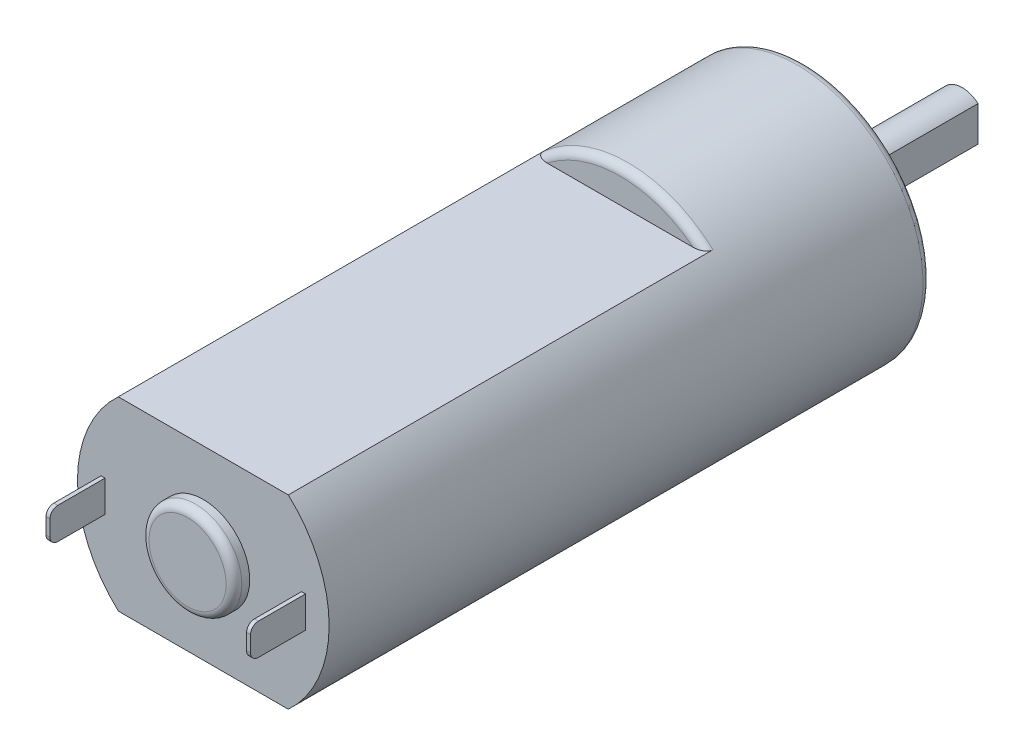
ISO-10303-21;
HEADER;
FILE_DESCRIPTION(('STEP AP214'),'2;1');
FILE_NAME('part.step','',(''),(''),'','','');
FILE_SCHEMA(('AUTOMOTIVE_DESIGN { 1 0 10303 214 1 1 1 1 }'));
ENDSEC;
DATA;
#1=APPLICATION_CONTEXT('core data for automotive mechanical design processes');
#2=APPLICATION_PROTOCOL_DEFINITION('international standard','automotive_design',2000,#1);
#3=PRODUCT_CONTEXT('',#1,'mechanical');
#4=PRODUCT('Part','Part','',(#3));
#5=PRODUCT_RELATED_PRODUCT_CATEGORY('part','',(#4));
#6=PRODUCT_DEFINITION_FORMATION('','',#4);
#7=PRODUCT_DEFINITION_CONTEXT('part definition',#1,'design');
#8=PRODUCT_DEFINITION('design','',#6,#7);
#9=PRODUCT_DEFINITION_SHAPE('','',#8);
#10=(LENGTH_UNIT() NAMED_UNIT(*) SI_UNIT(.MILLI.,.METRE.));
#11=(NAMED_UNIT(*) PLANE_ANGLE_UNIT() SI_UNIT($,.RADIAN.));
#12=(NAMED_UNIT(*) SI_UNIT($,.STERADIAN.) SOLID_ANGLE_UNIT());
#13=UNCERTAINTY_MEASURE_WITH_UNIT(LENGTH_MEASURE(1.E-05),#10,'distance_accuracy_value','');
#14=(GEOMETRIC_REPRESENTATION_CONTEXT(3) GLOBAL_UNCERTAINTY_ASSIGNED_CONTEXT((#13)) GLOBAL_UNIT_ASSIGNED_CONTEXT((#10,
#11,#12)) REPRESENTATION_CONTEXT('',''));
#15=CARTESIAN_POINT('',(0.,0.,0.));
#16=DIRECTION('',(0.,0.,1.));
#17=DIRECTION('',(1.,0.,0.));
#18=AXIS2_PLACEMENT_3D('',#15,#16,#17);
#19=CARTESIAN_POINT('',(8.,0.,38.25));
#20=DIRECTION('',(0.,0.,1.));
#21=DIRECTION('',(1.,0.,0.));
#22=AXIS2_PLACEMENT_3D('',#19,#20,#21);
#23=PLANE('',#22);
#24=CARTESIAN_POINT('',(0.,0.,38.25));
#25=DIRECTION('',(0.,0.,1.));
#26=DIRECTION('',(1.,0.,0.));
#27=AXIS2_PLACEMENT_3D('',#24,#25,#26);
#28=CIRCLE('',#27,2.95);
#29=CARTESIAN_POINT('',(2.95,0.,38.25));
#30=VERTEX_POINT('',#29);
#31=EDGE_CURVE('E208',#30,#30,#28,.T.);
#32=ORIENTED_EDGE('',*,*,#31,.F.);
#33=EDGE_LOOP('',(#32));
#34=FACE_BOUND('',#33,.T.);
#35=DIRECTION('',(-1.,0.,0.));
#36=VECTOR('',#35,1.);
#37=CARTESIAN_POINT('',(5.40277706369604,-5.9,38.25));
#38=LINE('',#37,#36);
#39=CARTESIAN_POINT('',(5.40277706369604,-5.9,38.25));
#40=VERTEX_POINT('',#39);
#41=CARTESIAN_POINT('',(-5.40277706369604,-5.9,38.25));
#42=VERTEX_POINT('',#41);
#43=EDGE_CURVE('E249',#40,#42,#38,.T.);
#44=ORIENTED_EDGE('',*,*,#43,.F.);
#45=CARTESIAN_POINT('',(0.,0.,38.25));
#46=DIRECTION('',(0.,0.,-1.));
#47=DIRECTION('',(-1.,0.,0.));
#48=AXIS2_PLACEMENT_3D('',#45,#46,#47);
#49=CIRCLE('',#48,8.);
#50=CARTESIAN_POINT('',(5.40277706369604,5.9,38.25));
#51=VERTEX_POINT('',#50);
#52=EDGE_CURVE('E304',#51,#40,#49,.T.);
#53=ORIENTED_EDGE('',*,*,#52,.F.);
#54=DIRECTION('',(1.,0.,0.));
#55=VECTOR('',#54,1.);
#56=CARTESIAN_POINT('',(-5.40277706369604,5.9,38.25));
#57=LINE('',#56,#55);
#58=CARTESIAN_POINT('',(-5.40277706369604,5.9,38.25));
#59=VERTEX_POINT('',#58);
#60=EDGE_CURVE('E258',#59,#51,#57,.T.);
#61=ORIENTED_EDGE('',*,*,#60,.F.);
#62=EDGE_CURVE('E299',#42,#59,#49,.T.);
#63=ORIENTED_EDGE('',*,*,#62,.F.);
#64=EDGE_LOOP('',(#44,#53,#61,#63));
#65=FACE_BOUND('',#64,.T.);
#66=DIRECTION('',(1.,0.,0.));
#67=VECTOR('',#66,1.);
#68=CARTESIAN_POINT('',(-6.25,-1.,38.25));
#69=LINE('',#68,#67);
#70=CARTESIAN_POINT('',(-6.5,-1.,38.25));
#71=VERTEX_POINT('',#70);
#72=CARTESIAN_POINT('',(-6.25,-1.,38.25));
#73=VERTEX_POINT('',#72);
#74=EDGE_CURVE('E234',#71,#73,#69,.T.);
#75=ORIENTED_EDGE('',*,*,#74,.F.);
#76=DIRECTION('',(0.,-1.,0.));
#77=VECTOR('',#76,1.);
#78=CARTESIAN_POINT('',(-6.5,-1.,38.25));
#79=LINE('',#78,#77);
#80=CARTESIAN_POINT('',(-6.5,1.,38.25));
#81=VERTEX_POINT('',#80);
#82=EDGE_CURVE('E196',#81,#71,#79,.T.);
#83=ORIENTED_EDGE('',*,*,#82,.F.);
#84=DIRECTION('',(-1.,0.,0.));
#85=VECTOR('',#84,1.);
#86=CARTESIAN_POINT('',(-6.5,1.,38.25));
#87=LINE('',#86,#85);
#88=CARTESIAN_POINT('',(-6.25,1.,38.25));
#89=VERTEX_POINT('',#88);
#90=EDGE_CURVE('E228',#89,#81,#87,.T.);
#91=ORIENTED_EDGE('',*,*,#90,.F.);
#92=DIRECTION('',(0.,1.,0.));
#93=VECTOR('',#92,1.);
#94=CARTESIAN_POINT('',(-6.25,1.,38.25));
#95=LINE('',#94,#93);
#96=EDGE_CURVE('E237',#73,#89,#95,.T.);
#97=ORIENTED_EDGE('',*,*,#96,.F.);
#98=EDGE_LOOP('',(#75,#83,#91,#97));
#99=FACE_BOUND('',#98,.T.);
#100=DIRECTION('',(1.,0.,0.));
#101=VECTOR('',#100,1.);
#102=CARTESIAN_POINT('',(6.5,-1.,38.25));
#103=LINE('',#102,#101);
#104=CARTESIAN_POINT('',(6.25,-1.,38.25));
#105=VERTEX_POINT('',#104);
#106=CARTESIAN_POINT('',(6.5,-1.,38.25));
#107=VERTEX_POINT('',#106);
#108=EDGE_CURVE('E190',#105,#107,#103,.T.);
#109=ORIENTED_EDGE('',*,*,#108,.F.);
#110=DIRECTION('',(0.,-1.,0.));
#111=VECTOR('',#110,1.);
#112=CARTESIAN_POINT('',(6.25,-1.,38.25));
#113=LINE('',#112,#111);
#114=CARTESIAN_POINT('',(6.25,1.,38.25));
#115=VERTEX_POINT('',#114);
#116=EDGE_CURVE('E200',#115,#105,#113,.T.);
#117=ORIENTED_EDGE('',*,*,#116,.F.);
#118=DIRECTION('',(-1.,0.,0.));
#119=VECTOR('',#118,1.);
#120=CARTESIAN_POINT('',(6.25,1.,38.25));
#121=LINE('',#120,#119);
#122=CARTESIAN_POINT('',(6.5,1.,38.25));
#123=VERTEX_POINT('',#122);
#124=EDGE_CURVE('E213',#123,#115,#121,.T.);
#125=ORIENTED_EDGE('',*,*,#124,.F.);
#126=DIRECTION('',(0.,1.,0.));
#127=VECTOR('',#126,1.);
#128=CARTESIAN_POINT('',(6.5,1.,38.25));
#129=LINE('',#128,#127);
#130=EDGE_CURVE('E211',#107,#123,#129,.T.);
#131=ORIENTED_EDGE('',*,*,#130,.F.);
#132=EDGE_LOOP('',(#109,#117,#125,#131));
#133=FACE_BOUND('',#132,.T.);
#134=ADVANCED_FACE('F36',(#34,#65,#99,#133),#23,.T.);
#135=CARTESIAN_POINT('',(0.,0.,38.25));
#136=DIRECTION('',(0.,0.,-1.));
#137=DIRECTION('',(-1.,0.,0.));
#138=AXIS2_PLACEMENT_3D('',#135,#136,#137);
#139=CYLINDRICAL_SURFACE('',#138,8.);
#140=CARTESIAN_POINT('',(0.,0.,0.5));
#141=DIRECTION('',(0.,0.,-1.));
#142=DIRECTION('',(-1.,0.,0.));
#143=AXIS2_PLACEMENT_3D('',#140,#141,#142);
#144=CIRCLE('',#143,8.);
#145=CARTESIAN_POINT('',(-8.,0.,0.5));
#146=VERTEX_POINT('',#145);
#147=EDGE_CURVE('E342',#146,#146,#144,.F.);
#148=ORIENTED_EDGE('',*,*,#147,.T.);
#149=EDGE_LOOP('',(#148));
#150=FACE_BOUND('',#149,.T.);
#151=DIRECTION('',(0.,0.,1.));
#152=VECTOR('',#151,1.);
#153=CARTESIAN_POINT('',(5.40277706369604,-5.9,11.75));
#154=LINE('',#153,#152);
#155=CARTESIAN_POINT('',(5.40277706369604,-5.9,11.25));
#156=VERTEX_POINT('',#155);
#157=EDGE_CURVE('E253',#156,#40,#154,.T.);
#158=ORIENTED_EDGE('',*,*,#157,.F.);
#159=CARTESIAN_POINT('',(0.,0.,11.25));
#160=DIRECTION('',(0.,0.,1.));
#161=DIRECTION('',(1.,0.,0.));
#162=AXIS2_PLACEMENT_3D('',#159,#160,#161);
#163=CIRCLE('',#162,8.);
#164=CARTESIAN_POINT('',(-5.40277706369604,-5.9,11.25));
#165=VERTEX_POINT('',#164);
#166=EDGE_CURVE('E348',#156,#165,#163,.F.);
#167=ORIENTED_EDGE('',*,*,#166,.T.);
#168=DIRECTION('',(0.,0.,1.));
#169=VECTOR('',#168,1.);
#170=CARTESIAN_POINT('',(-5.40277706369604,-5.9,11.75));
#171=LINE('',#170,#169);
#172=EDGE_CURVE('E255',#165,#42,#171,.T.);
#173=ORIENTED_EDGE('',*,*,#172,.T.);
#174=ORIENTED_EDGE('',*,*,#62,.T.);
#175=DIRECTION('',(0.,0.,1.));
#176=VECTOR('',#175,1.);
#177=CARTESIAN_POINT('',(-5.40277706369604,5.9,11.75));
#178=LINE('',#177,#176);
#179=CARTESIAN_POINT('',(-5.40277706369604,5.9,11.25));
#180=VERTEX_POINT('',#179);
#181=EDGE_CURVE('E262',#180,#59,#178,.T.);
#182=ORIENTED_EDGE('',*,*,#181,.F.);
#183=CARTESIAN_POINT('',(0.,0.,11.25));
#184=DIRECTION('',(0.,0.,1.));
#185=DIRECTION('',(1.,0.,0.));
#186=AXIS2_PLACEMENT_3D('',#183,#184,#185);
#187=CIRCLE('',#186,8.);
#188=CARTESIAN_POINT('',(5.40277706369604,5.9,11.25));
#189=VERTEX_POINT('',#188);
#190=EDGE_CURVE('E345',#180,#189,#187,.F.);
#191=ORIENTED_EDGE('',*,*,#190,.T.);
#192=DIRECTION('',(0.,0.,1.));
#193=VECTOR('',#192,1.);
#194=CARTESIAN_POINT('',(5.40277706369604,5.9,11.75));
#195=LINE('',#194,#193);
#196=EDGE_CURVE('E264',#189,#51,#195,.T.);
#197=ORIENTED_EDGE('',*,*,#196,.T.);
#198=ORIENTED_EDGE('',*,*,#52,.T.);
#199=EDGE_LOOP('',(#158,#167,#173,#174,#182,#191,#197,#198));
#200=FACE_BOUND('',#199,.T.);
#201=ADVANCED_FACE('F440',(#150,#200),#139,.T.);
#202=CARTESIAN_POINT('',(0.,0.,0.));
#203=DIRECTION('',(0.,0.,-1.));
#204=DIRECTION('',(-1.,0.,0.));
#205=AXIS2_PLACEMENT_3D('',#202,#203,#204);
#206=PLANE('',#205);
#207=CARTESIAN_POINT('',(0.,0.,0.));
#208=DIRECTION('',(0.,0.,-1.));
#209=DIRECTION('',(-1.,0.,0.));
#210=AXIS2_PLACEMENT_3D('',#207,#208,#209);
#211=CIRCLE('',#210,7.5);
#212=CARTESIAN_POINT('',(-7.5,0.,0.));
#213=VERTEX_POINT('',#212);
#214=EDGE_CURVE('E355',#213,#213,#211,.T.);
#215=ORIENTED_EDGE('',*,*,#214,.T.);
#216=EDGE_LOOP('',(#215));
#217=FACE_BOUND('',#216,.T.);
#218=CARTESIAN_POINT('',(0.,0.,0.));
#219=DIRECTION('',(0.,0.,-1.));
#220=DIRECTION('',(0.,1.,0.));
#221=AXIS2_PLACEMENT_3D('',#218,#219,#220);
#222=CIRCLE('',#221,3.);
#223=CARTESIAN_POINT('',(0.,3.,0.));
#224=VERTEX_POINT('',#223);
#225=EDGE_CURVE('E300',#224,#224,#222,.T.);
#226=ORIENTED_EDGE('',*,*,#225,.F.);
#227=EDGE_LOOP('',(#226));
#228=FACE_BOUND('',#227,.T.);
#229=ADVANCED_FACE('F436',(#217,#228),#206,.T.);
#230=CARTESIAN_POINT('',(0.,0.,-2.));
#231=DIRECTION('',(0.,0.,1.));
#232=DIRECTION('',(0.,-1.,0.));
#233=AXIS2_PLACEMENT_3D('',#230,#231,#232);
#234=CYLINDRICAL_SURFACE('',#233,3.);
#235=CARTESIAN_POINT('',(0.,0.,-2.));
#236=DIRECTION('',(0.,0.,-1.));
#237=DIRECTION('',(0.,1.,0.));
#238=AXIS2_PLACEMENT_3D('',#235,#236,#237);
#239=CIRCLE('',#238,3.);
#240=CARTESIAN_POINT('',(0.,3.,-2.));
#241=VERTEX_POINT('',#240);
#242=EDGE_CURVE('E296',#241,#241,#239,.T.);
#243=ORIENTED_EDGE('',*,*,#242,.F.);
#244=EDGE_LOOP('',(#243));
#245=FACE_BOUND('',#244,.T.);
#246=ORIENTED_EDGE('',*,*,#225,.T.);
#247=EDGE_LOOP('',(#246));
#248=FACE_BOUND('',#247,.T.);
#249=ADVANCED_FACE('F432',(#245,#248),#234,.T.);
#250=CARTESIAN_POINT('',(0.,0.,-2.));
#251=DIRECTION('',(0.,0.,-1.));
#252=DIRECTION('',(0.,1.,0.));
#253=AXIS2_PLACEMENT_3D('',#250,#251,#252);
#254=PLANE('',#253);
#255=CARTESIAN_POINT('',(0.,0.,-2.));
#256=DIRECTION('',(0.,0.,-1.));
#257=DIRECTION('',(0.,1.,0.));
#258=AXIS2_PLACEMENT_3D('',#255,#256,#257);
#259=CIRCLE('',#258,1.5);
#260=CARTESIAN_POINT('',(1.,1.1180339887499,-2.));
#261=VERTEX_POINT('',#260);
#262=CARTESIAN_POINT('',(1.,-1.11803398874989,-2.));
#263=VERTEX_POINT('',#262);
#264=EDGE_CURVE('E267',#261,#263,#259,.T.);
#265=ORIENTED_EDGE('',*,*,#264,.F.);
#266=CARTESIAN_POINT('',(0.,0.,-2.));
#267=DIRECTION('',(0.,0.,-1.));
#268=DIRECTION('',(0.,-1.,0.));
#269=AXIS2_PLACEMENT_3D('',#266,#267,#268);
#270=CIRCLE('',#269,1.5);
#271=EDGE_CURVE('E280',#263,#261,#270,.T.);
#272=ORIENTED_EDGE('',*,*,#271,.F.);
#273=EDGE_LOOP('',(#265,#272));
#274=FACE_BOUND('',#273,.T.);
#275=ORIENTED_EDGE('',*,*,#242,.T.);
#276=EDGE_LOOP('',(#275));
#277=FACE_BOUND('',#276,.T.);
#278=ADVANCED_FACE('F428',(#274,#277),#254,.T.);
#279=CARTESIAN_POINT('',(0.,0.,-10.));
#280=DIRECTION('',(0.,0.,1.));
#281=DIRECTION('',(0.,-1.,0.));
#282=AXIS2_PLACEMENT_3D('',#279,#280,#281);
#283=CYLINDRICAL_SURFACE('',#282,1.5);
#284=ORIENTED_EDGE('',*,*,#271,.T.);
#285=DIRECTION('',(0.,0.,1.));
#286=VECTOR('',#285,1.);
#287=CARTESIAN_POINT('',(1.,1.1180339887499,-10.));
#288=LINE('',#287,#286);
#289=CARTESIAN_POINT('',(1.,1.1180339887499,-10.));
#290=VERTEX_POINT('',#289);
#291=EDGE_CURVE('E293',#290,#261,#288,.T.);
#292=ORIENTED_EDGE('',*,*,#291,.F.);
#293=CARTESIAN_POINT('',(0.,0.,-10.));
#294=DIRECTION('',(0.,0.,-1.));
#295=DIRECTION('',(0.,-1.,0.));
#296=AXIS2_PLACEMENT_3D('',#293,#294,#295);
#297=CIRCLE('',#296,1.5);
#298=CARTESIAN_POINT('',(1.,-1.11803398874989,-10.));
#299=VERTEX_POINT('',#298);
#300=EDGE_CURVE('E283',#299,#290,#297,.T.);
#301=ORIENTED_EDGE('',*,*,#300,.F.);
#302=DIRECTION('',(0.,0.,1.));
#303=VECTOR('',#302,1.);
#304=CARTESIAN_POINT('',(1.,-1.11803398874989,-10.));
#305=LINE('',#304,#303);
#306=EDGE_CURVE('E288',#299,#263,#305,.T.);
#307=ORIENTED_EDGE('',*,*,#306,.T.);
#308=EDGE_LOOP('',(#284,#292,#301,#307));
#309=FACE_BOUND('',#308,.T.);
#310=ADVANCED_FACE('F424',(#309),#283,.T.);
#311=CARTESIAN_POINT('',(1.,-1.11803398874989,-10.));
#312=DIRECTION('',(-1.,0.,0.));
#313=DIRECTION('',(0.,0.,1.));
#314=AXIS2_PLACEMENT_3D('',#311,#312,#313);
#315=PLANE('',#314);
#316=ORIENTED_EDGE('',*,*,#291,.T.);
#317=DIRECTION('',(0.,0.,-1.));
#318=VECTOR('',#317,1.);
#319=CARTESIAN_POINT('',(1.,1.1180339887499,0.));
#320=LINE('',#319,#318);
#321=CARTESIAN_POINT('',(1.,1.1180339887499,0.));
#322=VERTEX_POINT('',#321);
#323=EDGE_CURVE('E278',#322,#261,#320,.T.);
#324=ORIENTED_EDGE('',*,*,#323,.F.);
#325=DIRECTION('',(0.,1.,0.));
#326=VECTOR('',#325,1.);
#327=CARTESIAN_POINT('',(1.,-1.11803398874989,0.));
#328=LINE('',#327,#326);
#329=CARTESIAN_POINT('',(1.,-1.11803398874989,0.));
#330=VERTEX_POINT('',#329);
#331=EDGE_CURVE('E273',#330,#322,#328,.T.);
#332=ORIENTED_EDGE('',*,*,#331,.F.);
#333=DIRECTION('',(0.,0.,-1.));
#334=VECTOR('',#333,1.);
#335=CARTESIAN_POINT('',(1.,-1.11803398874989,0.));
#336=LINE('',#335,#334);
#337=EDGE_CURVE('E276',#330,#263,#336,.T.);
#338=ORIENTED_EDGE('',*,*,#337,.T.);
#339=ORIENTED_EDGE('',*,*,#306,.F.);
#340=DIRECTION('',(0.,-1.,0.));
#341=VECTOR('',#340,1.);
#342=CARTESIAN_POINT('',(1.,-1.11803398874989,-10.));
#343=LINE('',#342,#341);
#344=EDGE_CURVE('E286',#290,#299,#343,.T.);
#345=ORIENTED_EDGE('',*,*,#344,.F.);
#346=EDGE_LOOP('',(#316,#324,#332,#338,#339,#345));
#347=FACE_BOUND('',#346,.T.);
#348=ADVANCED_FACE('F420',(#347),#315,.F.);
#349=CARTESIAN_POINT('',(0.,0.,-10.));
#350=DIRECTION('',(0.,0.,1.));
#351=DIRECTION('',(0.,-1.,0.));
#352=AXIS2_PLACEMENT_3D('',#349,#350,#351);
#353=PLANE('',#352);
#354=ORIENTED_EDGE('',*,*,#300,.T.);
#355=ORIENTED_EDGE('',*,*,#344,.T.);
#356=EDGE_LOOP('',(#354,#355));
#357=FACE_BOUND('',#356,.T.);
#358=ADVANCED_FACE('F416',(#357),#353,.F.);
#359=CARTESIAN_POINT('',(0.,0.,0.));
#360=DIRECTION('',(0.,0.,-1.));
#361=DIRECTION('',(0.,1.,0.));
#362=AXIS2_PLACEMENT_3D('',#359,#360,#361);
#363=CYLINDRICAL_SURFACE('',#362,1.5);
#364=ORIENTED_EDGE('',*,*,#264,.T.);
#365=ORIENTED_EDGE('',*,*,#337,.F.);
#366=CARTESIAN_POINT('',(0.,0.,0.));
#367=DIRECTION('',(0.,0.,-1.));
#368=DIRECTION('',(0.,1.,0.));
#369=AXIS2_PLACEMENT_3D('',#366,#367,#368);
#370=CIRCLE('',#369,1.5);
#371=EDGE_CURVE('E270',#322,#330,#370,.T.);
#372=ORIENTED_EDGE('',*,*,#371,.F.);
#373=ORIENTED_EDGE('',*,*,#323,.T.);
#374=EDGE_LOOP('',(#364,#365,#372,#373));
#375=FACE_BOUND('',#374,.T.);
#376=ADVANCED_FACE('F412',(#375),#363,.F.);
#377=CARTESIAN_POINT('',(0.,0.,0.));
#378=DIRECTION('',(0.,0.,-1.));
#379=DIRECTION('',(0.,1.,0.));
#380=AXIS2_PLACEMENT_3D('',#377,#378,#379);
#381=PLANE('',#380);
#382=ORIENTED_EDGE('',*,*,#371,.T.);
#383=ORIENTED_EDGE('',*,*,#331,.T.);
#384=EDGE_LOOP('',(#382,#383));
#385=FACE_BOUND('',#384,.T.);
#386=ADVANCED_FACE('F408',(#385),#381,.T.);
#387=CARTESIAN_POINT('',(-5.40277706369604,5.9,11.75));
#388=DIRECTION('',(0.,-1.,0.));
#389=DIRECTION('',(0.,0.,-1.));
#390=AXIS2_PLACEMENT_3D('',#387,#388,#389);
#391=PLANE('',#390);
#392=ORIENTED_EDGE('',*,*,#60,.T.);
#393=ORIENTED_EDGE('',*,*,#196,.F.);
#394=CARTESIAN_POINT('',(5.40277706369604,5.9,11.25));
#395=CARTESIAN_POINT('',(5.40283148037578,5.9,11.271740354385));
#396=CARTESIAN_POINT('',(5.40068145650954,5.9,11.2934214979406));
#397=CARTESIAN_POINT('',(5.39244910932837,5.9,11.3358265552683));
#398=CARTESIAN_POINT('',(5.3864030966777,5.9,11.3565574336463));
#399=CARTESIAN_POINT('',(5.37086328192421,5.9,11.3965861080966));
#400=CARTESIAN_POINT('',(5.36137984485646,5.9,11.4158880045352));
#401=CARTESIAN_POINT('',(5.33956212620102,5.9,11.4528400580769));
#402=CARTESIAN_POINT('',(5.32722102379949,5.9,11.4704861190474));
#403=CARTESIAN_POINT('',(5.29445160223145,5.9,11.5111774949092));
#404=CARTESIAN_POINT('',(5.27283264556323,5.9,11.5332625133925));
#405=CARTESIAN_POINT('',(5.22637640918798,5.9,11.5737049632588));
#406=CARTESIAN_POINT('',(5.2015336638736,5.9,11.5920559250548));
#407=CARTESIAN_POINT('',(5.13742256599078,5.9,11.6331194854585));
#408=CARTESIAN_POINT('',(5.09686909393764,5.9,11.6538180088405));
#409=CARTESIAN_POINT('',(5.01299952806607,5.9,11.6887157540364));
#410=CARTESIAN_POINT('',(4.96967379886557,5.9,11.7028907291789));
#411=CARTESIAN_POINT('',(4.87719267147399,5.9,11.7266130845183));
#412=CARTESIAN_POINT('',(4.82788513532073,5.9,11.735562421789));
#413=CARTESIAN_POINT('',(4.7537022478666,5.9,11.7443221965645));
#414=CARTESIAN_POINT('',(4.72906854979428,5.9,11.7464654940399));
#415=CARTESIAN_POINT('',(4.67973666058774,5.9,11.7493022282933));
#416=CARTESIAN_POINT('',(4.65503853571052,5.9,11.7499968081944));
#417=CARTESIAN_POINT('',(4.63033476111609,5.9,11.75));
#418=B_SPLINE_CURVE_WITH_KNOTS('',3,(#394,#395,#396,#397,#398,#399,#400,#401,#402,#403,#404,
#405,#406,#407,#408,#409,#410,#411,#412,#413,#414,#415,#416,#417),.UNSPECIFIED.,.F.,.F.,(4,2,2,
2,2,2,2,2,2,2,2,4),(0.,0.0650211052531943,0.129444809797018,0.193675848768125,0.258061807259542,
0.350259855511827,0.442616309900562,0.578454145179496,0.714792862983398,0.86464712024773,
0.938793964878145,1.01288228113366),.UNSPECIFIED.);
#419=CARTESIAN_POINT('',(4.63033476111609,5.9,11.75));
#420=VERTEX_POINT('',#419);
#421=EDGE_CURVE('E11',#189,#420,#418,.T.);
#422=ORIENTED_EDGE('',*,*,#421,.T.);
#423=DIRECTION('',(1.,0.,0.));
#424=VECTOR('',#423,1.);
#425=CARTESIAN_POINT('',(-5.40277706369604,5.9,11.75));
#426=LINE('',#425,#424);
#427=CARTESIAN_POINT('',(-4.63033476111609,5.9,11.75));
#428=VERTEX_POINT('',#427);
#429=EDGE_CURVE('E260',#428,#420,#426,.T.);
#430=ORIENTED_EDGE('',*,*,#429,.F.);
#431=CARTESIAN_POINT('',(-4.63033476111609,5.9,11.75));
#432=CARTESIAN_POINT('',(-4.6641682274093,5.9,11.749988957991));
#433=CARTESIAN_POINT('',(-4.69801846710658,5.9,11.7486898824598));
#434=CARTESIAN_POINT('',(-4.76561160904134,5.9,11.7433218119897));
#435=CARTESIAN_POINT('',(-4.799353755663,5.9,11.7392434195812));
#436=CARTESIAN_POINT('',(-4.86680697722636,5.9,11.7280455893348));
#437=CARTESIAN_POINT('',(-4.90051153074315,5.9,11.7208859888755));
#438=CARTESIAN_POINT('',(-4.96699846697747,5.9,11.7032517508274));
#439=CARTESIAN_POINT('',(-4.99978223077647,5.9,11.692782402405));
#440=CARTESIAN_POINT('',(-5.06481815652157,5.9,11.6678489808302));
#441=CARTESIAN_POINT('',(-5.09703312652374,5.9,11.6532862751987));
#442=CARTESIAN_POINT('',(-5.15908421367495,5.9,11.6198897674006));
#443=CARTESIAN_POINT('',(-5.18892822340374,5.9,11.6010710137529));
#444=CARTESIAN_POINT('',(-5.23943244184093,5.9,11.5629672506763));
#445=CARTESIAN_POINT('',(-5.26073255984242,5.9,11.5445371303435));
#446=CARTESIAN_POINT('',(-5.30015504831505,5.9,11.5045072109228));
#447=CARTESIAN_POINT('',(-5.31828066071644,5.9,11.4829106874031));
#448=CARTESIAN_POINT('',(-5.34643025930964,5.9,11.4420719833267));
#449=CARTESIAN_POINT('',(-5.35735785033906,5.9,11.423454863643));
#450=CARTESIAN_POINT('',(-5.37600817165275,5.9,11.3846981441148));
#451=CARTESIAN_POINT('',(-5.38373830388993,5.9,11.3645621896338));
#452=CARTESIAN_POINT('',(-5.39391157646348,5.9,11.328673109413));
#453=CARTESIAN_POINT('',(-5.39721055230023,5.9,11.3131602979456));
#454=CARTESIAN_POINT('',(-5.40165517060596,5.9,11.2817717732035));
#455=CARTESIAN_POINT('',(-5.40279268347777,5.9,11.2658949162674));
#456=CARTESIAN_POINT('',(-5.40277706369604,5.9,11.25));
#457=B_SPLINE_CURVE_WITH_KNOTS('',3,(#431,#432,#433,#434,#435,#436,#437,#438,#439,#440,#441,
#442,#443,#444,#445,#446,#447,#448,#449,#450,#451,#452,#453,#454,#455,#456),.UNSPECIFIED.,.F.,
.F.,(4,2,2,2,2,2,2,2,2,2,2,2,4),(0.,0.101501389904644,0.203347691939891,0.306563769468945,
0.40961572857381,0.515402291029719,0.620820504731741,0.705038172506156,0.789169325911129,
0.853685168025768,0.918050811939881,0.965486069103751,1.01309938717797),.UNSPECIFIED.);
#458=EDGE_CURVE('E50',#428,#180,#457,.T.);
#459=ORIENTED_EDGE('',*,*,#458,.T.);
#460=ORIENTED_EDGE('',*,*,#181,.T.);
#461=EDGE_LOOP('',(#392,#393,#422,#430,#459,#460));
#462=FACE_BOUND('',#461,.T.);
#463=ADVANCED_FACE('F403',(#462),#391,.F.);
#464=CARTESIAN_POINT('',(0.,0.,11.75));
#465=DIRECTION('',(0.,0.,1.));
#466=DIRECTION('',(1.,0.,0.));
#467=AXIS2_PLACEMENT_3D('',#464,#465,#466);
#468=PLANE('',#467);
#469=ORIENTED_EDGE('',*,*,#429,.T.);
#470=CARTESIAN_POINT('',(0.,0.,11.75));
#471=DIRECTION('',(0.,0.,1.));
#472=DIRECTION('',(1.,0.,0.));
#473=AXIS2_PLACEMENT_3D('',#470,#471,#472);
#474=CIRCLE('',#473,7.5);
#475=EDGE_CURVE('E353',#420,#428,#474,.T.);
#476=ORIENTED_EDGE('',*,*,#475,.T.);
#477=EDGE_LOOP('',(#469,#476));
#478=FACE_BOUND('',#477,.T.);
#479=ADVANCED_FACE('F407',(#478),#468,.T.);
#480=CARTESIAN_POINT('',(5.40277706369604,-5.9,11.75));
#481=DIRECTION('',(0.,1.,0.));
#482=DIRECTION('',(0.,0.,1.));
#483=AXIS2_PLACEMENT_3D('',#480,#481,#482);
#484=PLANE('',#483);
#485=ORIENTED_EDGE('',*,*,#43,.T.);
#486=ORIENTED_EDGE('',*,*,#172,.F.);
#487=CARTESIAN_POINT('',(-5.40277706369604,-5.9,11.25));
#488=CARTESIAN_POINT('',(-5.40283148037578,-5.9,11.271740354385));
#489=CARTESIAN_POINT('',(-5.40068145650954,-5.9,11.2934214979406));
#490=CARTESIAN_POINT('',(-5.39244910932837,-5.9,11.3358265552683));
#491=CARTESIAN_POINT('',(-5.3864030966777,-5.9,11.3565574336463));
#492=CARTESIAN_POINT('',(-5.37086328192421,-5.9,11.3965861080966));
#493=CARTESIAN_POINT('',(-5.36137984485646,-5.9,11.4158880045352));
#494=CARTESIAN_POINT('',(-5.33956212620102,-5.9,11.4528400580769));
#495=CARTESIAN_POINT('',(-5.32722102379949,-5.9,11.4704861190474));
#496=CARTESIAN_POINT('',(-5.29445160223145,-5.9,11.5111774949092));
#497=CARTESIAN_POINT('',(-5.27283264556323,-5.9,11.5332625133925));
#498=CARTESIAN_POINT('',(-5.22637640918798,-5.9,11.5737049632588));
#499=CARTESIAN_POINT('',(-5.2015336638736,-5.9,11.5920559250548));
#500=CARTESIAN_POINT('',(-5.13742256599078,-5.9,11.6331194854585));
#501=CARTESIAN_POINT('',(-5.09686909393764,-5.9,11.6538180088405));
#502=CARTESIAN_POINT('',(-5.01299952806607,-5.9,11.6887157540364));
#503=CARTESIAN_POINT('',(-4.96967379886557,-5.9,11.7028907291789));
#504=CARTESIAN_POINT('',(-4.87719267147399,-5.9,11.7266130845183));
#505=CARTESIAN_POINT('',(-4.82788513532073,-5.9,11.735562421789));
#506=CARTESIAN_POINT('',(-4.7537022478666,-5.9,11.7443221965645));
#507=CARTESIAN_POINT('',(-4.72906854979428,-5.9,11.7464654940399));
#508=CARTESIAN_POINT('',(-4.67973666058774,-5.9,11.7493022282933));
#509=CARTESIAN_POINT('',(-4.65503853571052,-5.9,11.7499968081944));
#510=CARTESIAN_POINT('',(-4.63033476111609,-5.9,11.75));
#511=B_SPLINE_CURVE_WITH_KNOTS('',3,(#487,#488,#489,#490,#491,#492,#493,#494,#495,#496,#497,
#498,#499,#500,#501,#502,#503,#504,#505,#506,#507,#508,#509,#510),.UNSPECIFIED.,.F.,.F.,(4,2,2,
2,2,2,2,2,2,2,2,4),(0.,0.0650211052531943,0.129444809797018,0.193675848768125,0.258061807259542,
0.350259855511827,0.442616309900562,0.578454145179496,0.714792862983398,0.86464712024773,
0.938793964878145,1.01288228113366),.UNSPECIFIED.);
#512=CARTESIAN_POINT('',(-4.63033476111609,-5.9,11.75));
#513=VERTEX_POINT('',#512);
#514=EDGE_CURVE('E373',#165,#513,#511,.T.);
#515=ORIENTED_EDGE('',*,*,#514,.T.);
#516=DIRECTION('',(-1.,0.,0.));
#517=VECTOR('',#516,1.);
#518=CARTESIAN_POINT('',(5.40277706369604,-5.9,11.75));
#519=LINE('',#518,#517);
#520=CARTESIAN_POINT('',(4.63033476111609,-5.9,11.75));
#521=VERTEX_POINT('',#520);
#522=EDGE_CURVE('E250',#521,#513,#519,.T.);
#523=ORIENTED_EDGE('',*,*,#522,.F.);
#524=CARTESIAN_POINT('',(4.63033476111609,-5.9,11.75));
#525=CARTESIAN_POINT('',(4.6641682274093,-5.9,11.749988957991));
#526=CARTESIAN_POINT('',(4.69801846710658,-5.9,11.7486898824598));
#527=CARTESIAN_POINT('',(4.76561160904134,-5.9,11.7433218119897));
#528=CARTESIAN_POINT('',(4.799353755663,-5.9,11.7392434195812));
#529=CARTESIAN_POINT('',(4.86680697722636,-5.9,11.7280455893348));
#530=CARTESIAN_POINT('',(4.90051153074315,-5.9,11.7208859888755));
#531=CARTESIAN_POINT('',(4.96699846697747,-5.9,11.7032517508274));
#532=CARTESIAN_POINT('',(4.99978223077647,-5.9,11.692782402405));
#533=CARTESIAN_POINT('',(5.06481815652157,-5.9,11.6678489808302));
#534=CARTESIAN_POINT('',(5.09703312652374,-5.9,11.6532862751987));
#535=CARTESIAN_POINT('',(5.15908421367495,-5.9,11.6198897674006));
#536=CARTESIAN_POINT('',(5.18892822340374,-5.9,11.6010710137529));
#537=CARTESIAN_POINT('',(5.23943244184093,-5.9,11.5629672506763));
#538=CARTESIAN_POINT('',(5.26073255984242,-5.9,11.5445371303435));
#539=CARTESIAN_POINT('',(5.30015504831505,-5.9,11.5045072109228));
#540=CARTESIAN_POINT('',(5.31828066071644,-5.9,11.4829106874031));
#541=CARTESIAN_POINT('',(5.34643025930964,-5.9,11.4420719833267));
#542=CARTESIAN_POINT('',(5.35735785033906,-5.9,11.423454863643));
#543=CARTESIAN_POINT('',(5.37600817165275,-5.9,11.3846981441148));
#544=CARTESIAN_POINT('',(5.38373830388993,-5.9,11.3645621896338));
#545=CARTESIAN_POINT('',(5.39391157646348,-5.9,11.328673109413));
#546=CARTESIAN_POINT('',(5.39721055230023,-5.9,11.3131602979456));
#547=CARTESIAN_POINT('',(5.40165517060596,-5.9,11.2817717732035));
#548=CARTESIAN_POINT('',(5.40279268347777,-5.9,11.2658949162674));
#549=CARTESIAN_POINT('',(5.40277706369604,-5.9,11.25));
#550=B_SPLINE_CURVE_WITH_KNOTS('',3,(#524,#525,#526,#527,#528,#529,#530,#531,#532,#533,#534,
#535,#536,#537,#538,#539,#540,#541,#542,#543,#544,#545,#546,#547,#548,#549),.UNSPECIFIED.,.F.,
.F.,(4,2,2,2,2,2,2,2,2,2,2,2,4),(0.,0.101501389904644,0.203347691939891,0.306563769468945,
0.40961572857381,0.515402291029719,0.620820504731741,0.705038172506156,0.789169325911129,
0.853685168025768,0.918050811939881,0.965486069103751,1.01309938717797),.UNSPECIFIED.);
#551=EDGE_CURVE('E364',#521,#156,#550,.T.);
#552=ORIENTED_EDGE('',*,*,#551,.T.);
#553=ORIENTED_EDGE('',*,*,#157,.T.);
#554=EDGE_LOOP('',(#485,#486,#515,#523,#552,#553));
#555=FACE_BOUND('',#554,.T.);
#556=ADVANCED_FACE('F378',(#555),#484,.F.);
#557=CARTESIAN_POINT('',(0.,0.,11.75));
#558=DIRECTION('',(0.,0.,1.));
#559=DIRECTION('',(1.,0.,0.));
#560=AXIS2_PLACEMENT_3D('',#557,#558,#559);
#561=PLANE('',#560);
#562=ORIENTED_EDGE('',*,*,#522,.T.);
#563=CARTESIAN_POINT('',(0.,0.,11.75));
#564=DIRECTION('',(0.,0.,1.));
#565=DIRECTION('',(1.,0.,0.));
#566=AXIS2_PLACEMENT_3D('',#563,#564,#565);
#567=CIRCLE('',#566,7.5);
#568=EDGE_CURVE('E339',#513,#521,#567,.T.);
#569=ORIENTED_EDGE('',*,*,#568,.T.);
#570=EDGE_LOOP('',(#562,#569));
#571=FACE_BOUND('',#570,.T.);
#572=ADVANCED_FACE('F523',(#571),#561,.T.);
#573=CARTESIAN_POINT('',(-6.5,-1.,41.75));
#574=DIRECTION('',(1.,0.,0.));
#575=DIRECTION('',(0.,0.,-1.));
#576=AXIS2_PLACEMENT_3D('',#573,#574,#575);
#577=PLANE('',#576);
#578=DIRECTION('',(0.,-1.,0.));
#579=VECTOR('',#578,1.);
#580=CARTESIAN_POINT('',(-6.5,-1.,41.75));
#581=LINE('',#580,#579);
#582=CARTESIAN_POINT('',(-6.5,0.5,41.75));
#583=VERTEX_POINT('',#582);
#584=CARTESIAN_POINT('',(-6.5,-0.5,41.75));
#585=VERTEX_POINT('',#584);
#586=EDGE_CURVE('E224',#583,#585,#581,.T.);
#587=ORIENTED_EDGE('',*,*,#586,.F.);
#588=CARTESIAN_POINT('',(-6.5,0.5,41.25));
#589=DIRECTION('',(1.,0.,0.));
#590=DIRECTION('',(0.,0.,-1.));
#591=AXIS2_PLACEMENT_3D('',#588,#589,#590);
#592=CIRCLE('',#591,0.5);
#593=CARTESIAN_POINT('',(-6.5,1.,41.25));
#594=VERTEX_POINT('',#593);
#595=EDGE_CURVE('E314',#583,#594,#592,.F.);
#596=ORIENTED_EDGE('',*,*,#595,.T.);
#597=DIRECTION('',(0.,0.,-1.));
#598=VECTOR('',#597,1.);
#599=CARTESIAN_POINT('',(-6.5,1.,41.75));
#600=LINE('',#599,#598);
#601=EDGE_CURVE('E231',#594,#81,#600,.T.);
#602=ORIENTED_EDGE('',*,*,#601,.T.);
#603=ORIENTED_EDGE('',*,*,#82,.T.);
#604=DIRECTION('',(0.,0.,-1.));
#605=VECTOR('',#604,1.);
#606=CARTESIAN_POINT('',(-6.5,-1.,41.75));
#607=LINE('',#606,#605);
#608=CARTESIAN_POINT('',(-6.5,-1.,41.25));
#609=VERTEX_POINT('',#608);
#610=EDGE_CURVE('E247',#609,#71,#607,.T.);
#611=ORIENTED_EDGE('',*,*,#610,.F.);
#612=CARTESIAN_POINT('',(-6.5,-0.5,41.25));
#613=DIRECTION('',(1.,0.,0.));
#614=DIRECTION('',(0.,0.,-1.));
#615=AXIS2_PLACEMENT_3D('',#612,#613,#614);
#616=CIRCLE('',#615,0.5);
#617=EDGE_CURVE('E312',#609,#585,#616,.F.);
#618=ORIENTED_EDGE('',*,*,#617,.T.);
#619=EDGE_LOOP('',(#587,#596,#602,#603,#611,#618));
#620=FACE_BOUND('',#619,.T.);
#621=ADVANCED_FACE('F494',(#620),#577,.F.);
#622=CARTESIAN_POINT('',(-6.25,-1.,41.75));
#623=DIRECTION('',(0.,1.,0.));
#624=DIRECTION('',(0.,0.,1.));
#625=AXIS2_PLACEMENT_3D('',#622,#623,#624);
#626=PLANE('',#625);
#627=DIRECTION('',(0.,0.,-1.));
#628=VECTOR('',#627,1.);
#629=CARTESIAN_POINT('',(-6.25,-1.,41.75));
#630=LINE('',#629,#628);
#631=CARTESIAN_POINT('',(-6.25,-1.,41.25));
#632=VERTEX_POINT('',#631);
#633=EDGE_CURVE('E245',#632,#73,#630,.T.);
#634=ORIENTED_EDGE('',*,*,#633,.F.);
#635=DIRECTION('',(1.,0.,0.));
#636=VECTOR('',#635,1.);
#637=CARTESIAN_POINT('',(-6.25,-1.,41.25));
#638=LINE('',#637,#636);
#639=EDGE_CURVE('E351',#632,#609,#638,.F.);
#640=ORIENTED_EDGE('',*,*,#639,.T.);
#641=ORIENTED_EDGE('',*,*,#610,.T.);
#642=ORIENTED_EDGE('',*,*,#74,.T.);
#643=EDGE_LOOP('',(#634,#640,#641,#642));
#644=FACE_BOUND('',#643,.T.);
#645=ADVANCED_FACE('F488',(#644),#626,.F.);
#646=CARTESIAN_POINT('',(-6.25,1.,41.75));
#647=DIRECTION('',(-1.,0.,0.));
#648=DIRECTION('',(0.,0.,1.));
#649=AXIS2_PLACEMENT_3D('',#646,#647,#648);
#650=PLANE('',#649);
#651=DIRECTION('',(0.,0.,-1.));
#652=VECTOR('',#651,1.);
#653=CARTESIAN_POINT('',(-6.25,1.,41.75));
#654=LINE('',#653,#652);
#655=CARTESIAN_POINT('',(-6.25,1.,41.25));
#656=VERTEX_POINT('',#655);
#657=EDGE_CURVE('E243',#656,#89,#654,.T.);
#658=ORIENTED_EDGE('',*,*,#657,.F.);
#659=CARTESIAN_POINT('',(-6.25,0.5,41.25));
#660=DIRECTION('',(-1.,0.,0.));
#661=DIRECTION('',(0.,0.,1.));
#662=AXIS2_PLACEMENT_3D('',#659,#660,#661);
#663=CIRCLE('',#662,0.5);
#664=CARTESIAN_POINT('',(-6.25,0.5,41.75));
#665=VERTEX_POINT('',#664);
#666=EDGE_CURVE('E320',#656,#665,#663,.F.);
#667=ORIENTED_EDGE('',*,*,#666,.T.);
#668=DIRECTION('',(0.,1.,0.));
#669=VECTOR('',#668,1.);
#670=CARTESIAN_POINT('',(-6.25,1.,41.75));
#671=LINE('',#670,#669);
#672=CARTESIAN_POINT('',(-6.25,-0.5,41.75));
#673=VERTEX_POINT('',#672);
#674=EDGE_CURVE('E227',#673,#665,#671,.T.);
#675=ORIENTED_EDGE('',*,*,#674,.F.);
#676=CARTESIAN_POINT('',(-6.25,-0.5,41.25));
#677=DIRECTION('',(-1.,0.,0.));
#678=DIRECTION('',(0.,0.,1.));
#679=AXIS2_PLACEMENT_3D('',#676,#677,#678);
#680=CIRCLE('',#679,0.5);
#681=EDGE_CURVE('E318',#673,#632,#680,.F.);
#682=ORIENTED_EDGE('',*,*,#681,.T.);
#683=ORIENTED_EDGE('',*,*,#633,.T.);
#684=ORIENTED_EDGE('',*,*,#96,.T.);
#685=EDGE_LOOP('',(#658,#667,#675,#682,#683,#684));
#686=FACE_BOUND('',#685,.T.);
#687=ADVANCED_FACE('F502',(#686),#650,.F.);
#688=CARTESIAN_POINT('',(-6.5,1.,41.75));
#689=DIRECTION('',(0.,-1.,0.));
#690=DIRECTION('',(0.,0.,-1.));
#691=AXIS2_PLACEMENT_3D('',#688,#689,#690);
#692=PLANE('',#691);
#693=ORIENTED_EDGE('',*,*,#601,.F.);
#694=DIRECTION('',(-1.,0.,0.));
#695=VECTOR('',#694,1.);
#696=CARTESIAN_POINT('',(-6.5,1.,41.25));
#697=LINE('',#696,#695);
#698=EDGE_CURVE('E316',#594,#656,#697,.F.);
#699=ORIENTED_EDGE('',*,*,#698,.T.);
#700=ORIENTED_EDGE('',*,*,#657,.T.);
#701=ORIENTED_EDGE('',*,*,#90,.T.);
#702=EDGE_LOOP('',(#693,#699,#700,#701));
#703=FACE_BOUND('',#702,.T.);
#704=ADVANCED_FACE('F498',(#703),#692,.F.);
#705=CARTESIAN_POINT('',(0.,0.,41.75));
#706=DIRECTION('',(0.,0.,-1.));
#707=DIRECTION('',(-1.,0.,0.));
#708=AXIS2_PLACEMENT_3D('',#705,#706,#707);
#709=PLANE('',#708);
#710=ORIENTED_EDGE('',*,*,#674,.T.);
#711=DIRECTION('',(-1.,0.,0.));
#712=VECTOR('',#711,1.);
#713=CARTESIAN_POINT('',(0.,0.5,41.75));
#714=LINE('',#713,#712);
#715=EDGE_CURVE('E309',#665,#583,#714,.T.);
#716=ORIENTED_EDGE('',*,*,#715,.T.);
#717=ORIENTED_EDGE('',*,*,#586,.T.);
#718=DIRECTION('',(1.,0.,0.));
#719=VECTOR('',#718,1.);
#720=CARTESIAN_POINT('',(0.,-0.5,41.75));
#721=LINE('',#720,#719);
#722=EDGE_CURVE('E303',#585,#673,#721,.T.);
#723=ORIENTED_EDGE('',*,*,#722,.T.);
#724=EDGE_LOOP('',(#710,#716,#717,#723));
#725=FACE_BOUND('',#724,.T.);
#726=ADVANCED_FACE('F506',(#725),#709,.F.);
#727=CARTESIAN_POINT('',(6.25,-1.,41.75));
#728=DIRECTION('',(1.,0.,0.));
#729=DIRECTION('',(0.,0.,-1.));
#730=AXIS2_PLACEMENT_3D('',#727,#728,#729);
#731=PLANE('',#730);
#732=DIRECTION('',(0.,-1.,0.));
#733=VECTOR('',#732,1.);
#734=CARTESIAN_POINT('',(6.25,-1.,41.75));
#735=LINE('',#734,#733);
#736=CARTESIAN_POINT('',(6.25,0.5,41.75));
#737=VERTEX_POINT('',#736);
#738=CARTESIAN_POINT('',(6.25,-0.5,41.75));
#739=VERTEX_POINT('',#738);
#740=EDGE_CURVE('E218',#737,#739,#735,.T.);
#741=ORIENTED_EDGE('',*,*,#740,.F.);
#742=CARTESIAN_POINT('',(6.25,0.5,41.25));
#743=DIRECTION('',(1.,0.,0.));
#744=DIRECTION('',(0.,0.,-1.));
#745=AXIS2_PLACEMENT_3D('',#742,#743,#744);
#746=CIRCLE('',#745,0.5);
#747=CARTESIAN_POINT('',(6.25,1.,41.25));
#748=VERTEX_POINT('',#747);
#749=EDGE_CURVE('E330',#737,#748,#746,.F.);
#750=ORIENTED_EDGE('',*,*,#749,.T.);
#751=DIRECTION('',(0.,0.,-1.));
#752=VECTOR('',#751,1.);
#753=CARTESIAN_POINT('',(6.25,1.,41.75));
#754=LINE('',#753,#752);
#755=EDGE_CURVE('E204',#748,#115,#754,.T.);
#756=ORIENTED_EDGE('',*,*,#755,.T.);
#757=ORIENTED_EDGE('',*,*,#116,.T.);
#758=DIRECTION('',(0.,0.,-1.));
#759=VECTOR('',#758,1.);
#760=CARTESIAN_POINT('',(6.25,-1.,41.75));
#761=LINE('',#760,#759);
#762=CARTESIAN_POINT('',(6.25,-1.,41.25));
#763=VERTEX_POINT('',#762);
#764=EDGE_CURVE('E185',#763,#105,#761,.T.);
#765=ORIENTED_EDGE('',*,*,#764,.F.);
#766=CARTESIAN_POINT('',(6.25,-0.5,41.25));
#767=DIRECTION('',(1.,0.,0.));
#768=DIRECTION('',(0.,0.,-1.));
#769=AXIS2_PLACEMENT_3D('',#766,#767,#768);
#770=CIRCLE('',#769,0.5);
#771=EDGE_CURVE('E328',#763,#739,#770,.F.);
#772=ORIENTED_EDGE('',*,*,#771,.T.);
#773=EDGE_LOOP('',(#741,#750,#756,#757,#765,#772));
#774=FACE_BOUND('',#773,.T.);
#775=ADVANCED_FACE('F202',(#774),#731,.F.);
#776=CARTESIAN_POINT('',(6.5,-1.,41.75));
#777=DIRECTION('',(0.,1.,0.));
#778=DIRECTION('',(0.,0.,1.));
#779=AXIS2_PLACEMENT_3D('',#776,#777,#778);
#780=PLANE('',#779);
#781=DIRECTION('',(0.,0.,-1.));
#782=VECTOR('',#781,1.);
#783=CARTESIAN_POINT('',(6.5,-1.,41.75));
#784=LINE('',#783,#782);
#785=CARTESIAN_POINT('',(6.5,-1.,41.25));
#786=VERTEX_POINT('',#785);
#787=EDGE_CURVE('E197',#786,#107,#784,.T.);
#788=ORIENTED_EDGE('',*,*,#787,.F.);
#789=DIRECTION('',(1.,0.,0.));
#790=VECTOR('',#789,1.);
#791=CARTESIAN_POINT('',(6.5,-1.,41.25));
#792=LINE('',#791,#790);
#793=EDGE_CURVE('E193',#786,#763,#792,.F.);
#794=ORIENTED_EDGE('',*,*,#793,.T.);
#795=ORIENTED_EDGE('',*,*,#764,.T.);
#796=ORIENTED_EDGE('',*,*,#108,.T.);
#797=EDGE_LOOP('',(#788,#794,#795,#796));
#798=FACE_BOUND('',#797,.T.);
#799=ADVANCED_FACE('F188',(#798),#780,.F.);
#800=CARTESIAN_POINT('',(6.5,1.,41.75));
#801=DIRECTION('',(-1.,0.,0.));
#802=DIRECTION('',(0.,0.,1.));
#803=AXIS2_PLACEMENT_3D('',#800,#801,#802);
#804=PLANE('',#803);
#805=DIRECTION('',(0.,0.,-1.));
#806=VECTOR('',#805,1.);
#807=CARTESIAN_POINT('',(6.5,1.,41.75));
#808=LINE('',#807,#806);
#809=CARTESIAN_POINT('',(6.5,1.,41.25));
#810=VERTEX_POINT('',#809);
#811=EDGE_CURVE('E220',#810,#123,#808,.T.);
#812=ORIENTED_EDGE('',*,*,#811,.F.);
#813=CARTESIAN_POINT('',(6.5,0.5,41.25));
#814=DIRECTION('',(-1.,0.,0.));
#815=DIRECTION('',(0.,0.,1.));
#816=AXIS2_PLACEMENT_3D('',#813,#814,#815);
#817=CIRCLE('',#816,0.5);
#818=CARTESIAN_POINT('',(6.5,0.5,41.75));
#819=VERTEX_POINT('',#818);
#820=EDGE_CURVE('E336',#810,#819,#817,.F.);
#821=ORIENTED_EDGE('',*,*,#820,.T.);
#822=DIRECTION('',(0.,1.,0.));
#823=VECTOR('',#822,1.);
#824=CARTESIAN_POINT('',(6.5,1.,41.75));
#825=LINE('',#824,#823);
#826=CARTESIAN_POINT('',(6.5,-0.5,41.75));
#827=VERTEX_POINT('',#826);
#828=EDGE_CURVE('E221',#827,#819,#825,.T.);
#829=ORIENTED_EDGE('',*,*,#828,.F.);
#830=CARTESIAN_POINT('',(6.5,-0.5,41.25));
#831=DIRECTION('',(-1.,0.,0.));
#832=DIRECTION('',(0.,0.,1.));
#833=AXIS2_PLACEMENT_3D('',#830,#831,#832);
#834=CIRCLE('',#833,0.5);
#835=EDGE_CURVE('E334',#827,#786,#834,.F.);
#836=ORIENTED_EDGE('',*,*,#835,.T.);
#837=ORIENTED_EDGE('',*,*,#787,.T.);
#838=ORIENTED_EDGE('',*,*,#130,.T.);
#839=EDGE_LOOP('',(#812,#821,#829,#836,#837,#838));
#840=FACE_BOUND('',#839,.T.);
#841=ADVANCED_FACE('F466',(#840),#804,.F.);
#842=CARTESIAN_POINT('',(6.25,1.,41.75));
#843=DIRECTION('',(0.,-1.,0.));
#844=DIRECTION('',(0.,0.,-1.));
#845=AXIS2_PLACEMENT_3D('',#842,#843,#844);
#846=PLANE('',#845);
#847=ORIENTED_EDGE('',*,*,#755,.F.);
#848=DIRECTION('',(-1.,0.,0.));
#849=VECTOR('',#848,1.);
#850=CARTESIAN_POINT('',(6.25,1.,41.25));
#851=LINE('',#850,#849);
#852=EDGE_CURVE('E332',#748,#810,#851,.F.);
#853=ORIENTED_EDGE('',*,*,#852,.T.);
#854=ORIENTED_EDGE('',*,*,#811,.T.);
#855=ORIENTED_EDGE('',*,*,#124,.T.);
#856=EDGE_LOOP('',(#847,#853,#854,#855));
#857=FACE_BOUND('',#856,.T.);
#858=ADVANCED_FACE('F601',(#857),#846,.F.);
#859=CARTESIAN_POINT('',(0.,0.,41.75));
#860=DIRECTION('',(0.,0.,-1.));
#861=DIRECTION('',(-1.,0.,0.));
#862=AXIS2_PLACEMENT_3D('',#859,#860,#861);
#863=PLANE('',#862);
#864=ORIENTED_EDGE('',*,*,#828,.T.);
#865=DIRECTION('',(-1.,0.,0.));
#866=VECTOR('',#865,1.);
#867=CARTESIAN_POINT('',(0.,0.5,41.75));
#868=LINE('',#867,#866);
#869=EDGE_CURVE('E325',#819,#737,#868,.T.);
#870=ORIENTED_EDGE('',*,*,#869,.T.);
#871=ORIENTED_EDGE('',*,*,#740,.T.);
#872=DIRECTION('',(1.,0.,0.));
#873=VECTOR('',#872,1.);
#874=CARTESIAN_POINT('',(0.,-0.5,41.75));
#875=LINE('',#874,#873);
#876=EDGE_CURVE('E322',#739,#827,#875,.T.);
#877=ORIENTED_EDGE('',*,*,#876,.T.);
#878=EDGE_LOOP('',(#864,#870,#871,#877));
#879=FACE_BOUND('',#878,.T.);
#880=ADVANCED_FACE('F468',(#879),#863,.F.);
#881=CARTESIAN_POINT('',(0.,0.,39.25));
#882=DIRECTION('',(0.,0.,-1.));
#883=DIRECTION('',(-1.,0.,0.));
#884=AXIS2_PLACEMENT_3D('',#881,#882,#883);
#885=CYLINDRICAL_SURFACE('',#884,2.95);
#886=CARTESIAN_POINT('',(0.,0.,38.75));
#887=DIRECTION('',(0.,0.,1.));
#888=DIRECTION('',(1.,0.,0.));
#889=AXIS2_PLACEMENT_3D('',#886,#887,#888);
#890=CIRCLE('',#889,2.95);
#891=CARTESIAN_POINT('',(2.95,0.,38.75));
#892=VERTEX_POINT('',#891);
#893=EDGE_CURVE('E361',#892,#892,#890,.F.);
#894=ORIENTED_EDGE('',*,*,#893,.T.);
#895=EDGE_LOOP('',(#894));
#896=FACE_BOUND('',#895,.T.);
#897=ORIENTED_EDGE('',*,*,#31,.T.);
#898=EDGE_LOOP('',(#897));
#899=FACE_BOUND('',#898,.T.);
#900=ADVANCED_FACE('F476',(#896,#899),#885,.T.);
#901=CARTESIAN_POINT('',(0.,0.,39.25));
#902=DIRECTION('',(0.,0.,1.));
#903=DIRECTION('',(1.,0.,0.));
#904=AXIS2_PLACEMENT_3D('',#901,#902,#903);
#905=PLANE('',#904);
#906=CARTESIAN_POINT('',(0.,0.,39.25));
#907=DIRECTION('',(0.,0.,1.));
#908=DIRECTION('',(1.,0.,0.));
#909=AXIS2_PLACEMENT_3D('',#906,#907,#908);
#910=CIRCLE('',#909,2.45);
#911=CARTESIAN_POINT('',(2.45,0.,39.25));
#912=VERTEX_POINT('',#911);
#913=EDGE_CURVE('E358',#912,#912,#910,.T.);
#914=ORIENTED_EDGE('',*,*,#913,.T.);
#915=EDGE_LOOP('',(#914));
#916=FACE_BOUND('',#915,.T.);
#917=ADVANCED_FACE('F451',(#916),#905,.T.);
#918=CARTESIAN_POINT('',(0.,0.5,41.25));
#919=DIRECTION('',(-1.,0.,0.));
#920=DIRECTION('',(0.,0.,1.));
#921=AXIS2_PLACEMENT_3D('',#918,#919,#920);
#922=CYLINDRICAL_SURFACE('',#921,0.5);
#923=ORIENTED_EDGE('',*,*,#666,.F.);
#924=ORIENTED_EDGE('',*,*,#698,.F.);
#925=ORIENTED_EDGE('',*,*,#595,.F.);
#926=ORIENTED_EDGE('',*,*,#715,.F.);
#927=EDGE_LOOP('',(#923,#924,#925,#926));
#928=FACE_BOUND('',#927,.T.);
#929=ADVANCED_FACE('F448',(#928),#922,.T.);
#930=CARTESIAN_POINT('',(0.,0.5,41.25));
#931=DIRECTION('',(-1.,0.,0.));
#932=DIRECTION('',(0.,0.,1.));
#933=AXIS2_PLACEMENT_3D('',#930,#931,#932);
#934=CYLINDRICAL_SURFACE('',#933,0.5);
#935=ORIENTED_EDGE('',*,*,#820,.F.);
#936=ORIENTED_EDGE('',*,*,#852,.F.);
#937=ORIENTED_EDGE('',*,*,#749,.F.);
#938=ORIENTED_EDGE('',*,*,#869,.F.);
#939=EDGE_LOOP('',(#935,#936,#937,#938));
#940=FACE_BOUND('',#939,.T.);
#941=ADVANCED_FACE('F450',(#940),#934,.T.);
#942=CARTESIAN_POINT('',(0.,-0.5,41.25));
#943=DIRECTION('',(1.,0.,0.));
#944=DIRECTION('',(0.,0.,-1.));
#945=AXIS2_PLACEMENT_3D('',#942,#943,#944);
#946=CYLINDRICAL_SURFACE('',#945,0.5);
#947=ORIENTED_EDGE('',*,*,#771,.F.);
#948=ORIENTED_EDGE('',*,*,#793,.F.);
#949=ORIENTED_EDGE('',*,*,#835,.F.);
#950=ORIENTED_EDGE('',*,*,#876,.F.);
#951=EDGE_LOOP('',(#947,#948,#949,#950));
#952=FACE_BOUND('',#951,.T.);
#953=ADVANCED_FACE('F388',(#952),#946,.T.);
#954=CARTESIAN_POINT('',(0.,0.,11.25));
#955=DIRECTION('',(0.,0.,1.));
#956=DIRECTION('',(1.,0.,0.));
#957=AXIS2_PLACEMENT_3D('',#954,#955,#956);
#958=TOROIDAL_SURFACE('',#957,7.5,0.5);
#959=ORIENTED_EDGE('',*,*,#514,.F.);
#960=ORIENTED_EDGE('',*,*,#166,.F.);
#961=ORIENTED_EDGE('',*,*,#551,.F.);
#962=ORIENTED_EDGE('',*,*,#568,.F.);
#963=EDGE_LOOP('',(#959,#960,#961,#962));
#964=FACE_BOUND('',#963,.T.);
#965=ADVANCED_FACE('F382',(#964),#958,.T.);
#966=CARTESIAN_POINT('',(0.,-0.5,41.25));
#967=DIRECTION('',(1.,0.,0.));
#968=DIRECTION('',(0.,0.,-1.));
#969=AXIS2_PLACEMENT_3D('',#966,#967,#968);
#970=CYLINDRICAL_SURFACE('',#969,0.5);
#971=ORIENTED_EDGE('',*,*,#617,.F.);
#972=ORIENTED_EDGE('',*,*,#639,.F.);
#973=ORIENTED_EDGE('',*,*,#681,.F.);
#974=ORIENTED_EDGE('',*,*,#722,.F.);
#975=EDGE_LOOP('',(#971,#972,#973,#974));
#976=FACE_BOUND('',#975,.T.);
#977=ADVANCED_FACE('F387',(#976),#970,.T.);
#978=CARTESIAN_POINT('',(0.,0.,11.25));
#979=DIRECTION('',(0.,0.,1.));
#980=DIRECTION('',(1.,0.,0.));
#981=AXIS2_PLACEMENT_3D('',#978,#979,#980);
#982=TOROIDAL_SURFACE('',#981,7.5,0.5);
#983=ORIENTED_EDGE('',*,*,#421,.F.);
#984=ORIENTED_EDGE('',*,*,#190,.F.);
#985=ORIENTED_EDGE('',*,*,#458,.F.);
#986=ORIENTED_EDGE('',*,*,#475,.F.);
#987=EDGE_LOOP('',(#983,#984,#985,#986));
#988=FACE_BOUND('',#987,.T.);
#989=ADVANCED_FACE('F393',(#988),#982,.T.);
#990=CARTESIAN_POINT('',(0.,0.,0.5));
#991=DIRECTION('',(0.,0.,-1.));
#992=DIRECTION('',(-1.,0.,0.));
#993=AXIS2_PLACEMENT_3D('',#990,#991,#992);
#994=TOROIDAL_SURFACE('',#993,7.5,0.5);
#995=ORIENTED_EDGE('',*,*,#147,.F.);
#996=EDGE_LOOP('',(#995));
#997=FACE_BOUND('',#996,.T.);
#998=ORIENTED_EDGE('',*,*,#214,.F.);
#999=EDGE_LOOP('',(#998));
#1000=FACE_BOUND('',#999,.T.);
#1001=ADVANCED_FACE('F397',(#997,#1000),#994,.T.);
#1002=CARTESIAN_POINT('',(0.,0.,38.75));
#1003=DIRECTION('',(0.,0.,1.));
#1004=DIRECTION('',(1.,0.,0.));
#1005=AXIS2_PLACEMENT_3D('',#1002,#1003,#1004);
#1006=TOROIDAL_SURFACE('',#1005,2.45,0.5);
#1007=ORIENTED_EDGE('',*,*,#893,.F.);
#1008=EDGE_LOOP('',(#1007));
#1009=FACE_BOUND('',#1008,.T.);
#1010=ORIENTED_EDGE('',*,*,#913,.F.);
#1011=EDGE_LOOP('',(#1010));
#1012=FACE_BOUND('',#1011,.T.);
#1013=ADVANCED_FACE('F38',(#1009,#1012),#1006,.T.);
#1014=CLOSED_SHELL('',(#134,#201,#229,#249,#278,#310,#348,#358,#376,#386,#463,#479,#556,#572,
#621,#645,#687,#704,#726,#775,#799,#841,#858,#880,#900,#917,#929,#941,#953,#965,#977,#989,#1001,#1013));
#1015=MANIFOLD_SOLID_BREP('B2',#1014);
#1016=ADVANCED_BREP_SHAPE_REPRESENTATION('',(#18,#1015),#14);
#1017=SHAPE_DEFINITION_REPRESENTATION(#9,#1016);
ENDSEC;
END-ISO-10303-21;
